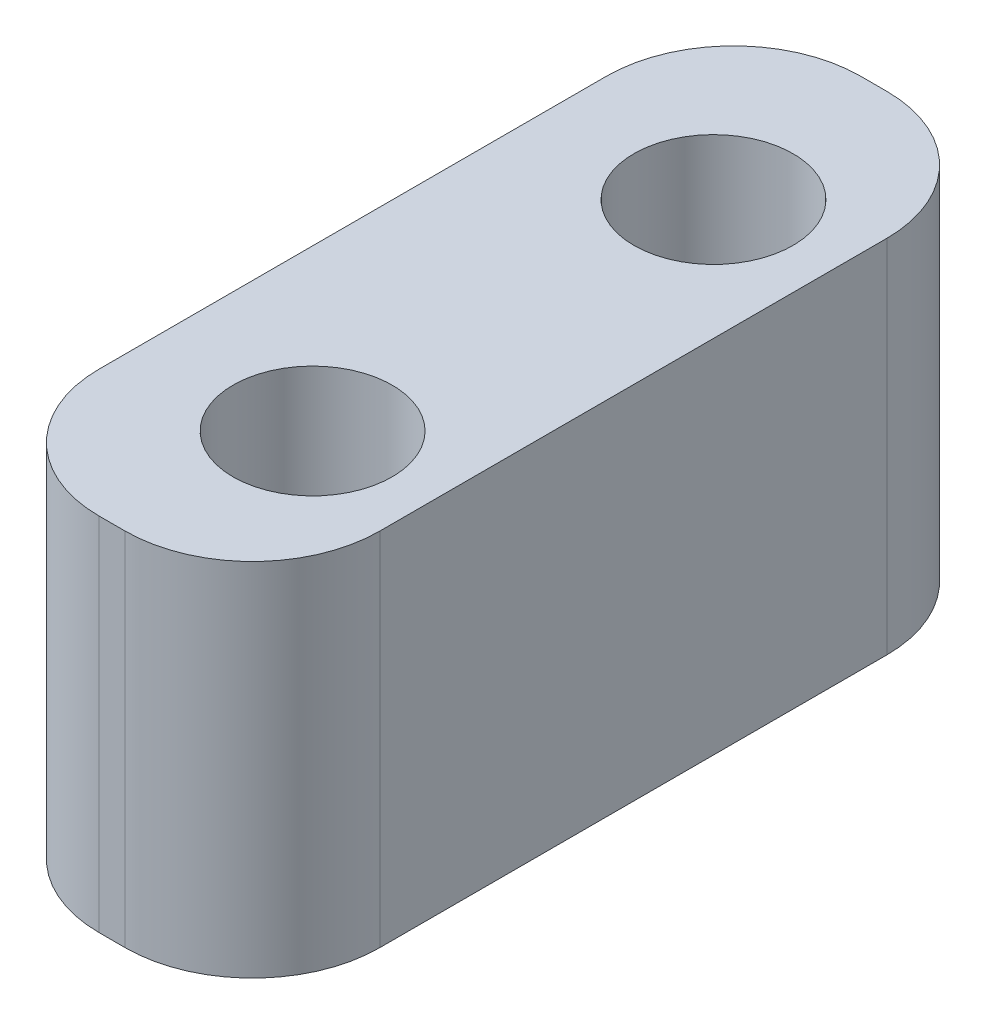
ISO-10303-21;
HEADER;
FILE_DESCRIPTION(('STEP AP214'),'2;1');
FILE_NAME('part.step','',(''),(''),'','','');
FILE_SCHEMA(('AUTOMOTIVE_DESIGN { 1 0 10303 214 1 1 1 1 }'));
ENDSEC;
DATA;
#1=APPLICATION_CONTEXT('core data for automotive mechanical design processes');
#2=APPLICATION_PROTOCOL_DEFINITION('international standard','automotive_design',2000,#1);
#3=PRODUCT_CONTEXT('',#1,'mechanical');
#4=PRODUCT('Part','Part','',(#3));
#5=PRODUCT_RELATED_PRODUCT_CATEGORY('part','',(#4));
#6=PRODUCT_DEFINITION_FORMATION('','',#4);
#7=PRODUCT_DEFINITION_CONTEXT('part definition',#1,'design');
#8=PRODUCT_DEFINITION('design','',#6,#7);
#9=PRODUCT_DEFINITION_SHAPE('','',#8);
#10=(LENGTH_UNIT() NAMED_UNIT(*) SI_UNIT(.MILLI.,.METRE.));
#11=(NAMED_UNIT(*) PLANE_ANGLE_UNIT() SI_UNIT($,.RADIAN.));
#12=(NAMED_UNIT(*) SI_UNIT($,.STERADIAN.) SOLID_ANGLE_UNIT());
#13=UNCERTAINTY_MEASURE_WITH_UNIT(LENGTH_MEASURE(1.E-05),#10,'distance_accuracy_value','');
#14=(GEOMETRIC_REPRESENTATION_CONTEXT(3) GLOBAL_UNCERTAINTY_ASSIGNED_CONTEXT((#13)) GLOBAL_UNIT_ASSIGNED_CONTEXT((#10,
#11,#12)) REPRESENTATION_CONTEXT('',''));
#15=CARTESIAN_POINT('',(0.,0.,0.));
#16=DIRECTION('',(0.,0.,1.));
#17=DIRECTION('',(1.,0.,0.));
#18=AXIS2_PLACEMENT_3D('',#15,#16,#17);
#19=CARTESIAN_POINT('',(0.,0.,19.));
#20=DIRECTION('',(1.,0.,0.));
#21=DIRECTION('',(0.,0.,-1.));
#22=AXIS2_PLACEMENT_3D('',#19,#20,#21);
#23=PLANE('',#22);
#24=DIRECTION('',(0.,0.,-1.));
#25=VECTOR('',#24,1.);
#26=CARTESIAN_POINT('',(0.,9.,19.));
#27=LINE('',#26,#25);
#28=CARTESIAN_POINT('',(0.,9.,15.825));
#29=VERTEX_POINT('',#28);
#30=CARTESIAN_POINT('',(0.,9.,3.175));
#31=VERTEX_POINT('',#30);
#32=EDGE_CURVE('E150',#29,#31,#27,.T.);
#33=ORIENTED_EDGE('',*,*,#32,.T.);
#34=DIRECTION('',(0.,-1.,0.));
#35=VECTOR('',#34,1.);
#36=CARTESIAN_POINT('',(0.,0.,3.175));
#37=LINE('',#36,#35);
#38=CARTESIAN_POINT('',(0.,0.,3.175));
#39=VERTEX_POINT('',#38);
#40=EDGE_CURVE('E112',#31,#39,#37,.T.);
#41=ORIENTED_EDGE('',*,*,#40,.T.);
#42=DIRECTION('',(0.,0.,-1.));
#43=VECTOR('',#42,1.);
#44=CARTESIAN_POINT('',(0.,0.,19.));
#45=LINE('',#44,#43);
#46=CARTESIAN_POINT('',(0.,0.,15.825));
#47=VERTEX_POINT('',#46);
#48=EDGE_CURVE('E104',#47,#39,#45,.T.);
#49=ORIENTED_EDGE('',*,*,#48,.F.);
#50=DIRECTION('',(0.,-1.,0.));
#51=VECTOR('',#50,1.);
#52=CARTESIAN_POINT('',(0.,0.,15.825));
#53=LINE('',#52,#51);
#54=EDGE_CURVE('E117',#47,#29,#53,.F.);
#55=ORIENTED_EDGE('',*,*,#54,.T.);
#56=EDGE_LOOP('',(#33,#41,#49,#55));
#57=FACE_BOUND('',#56,.T.);
#58=ADVANCED_FACE('F34',(#57),#23,.F.);
#59=CARTESIAN_POINT('',(0.,0.,19.));
#60=DIRECTION('',(0.,1.,0.));
#61=DIRECTION('',(0.,0.,1.));
#62=AXIS2_PLACEMENT_3D('',#59,#60,#61);
#63=PLANE('',#62);
#64=CARTESIAN_POINT('',(4.,0.,4.5));
#65=DIRECTION('',(0.,1.,0.));
#66=DIRECTION('',(0.,0.,1.));
#67=AXIS2_PLACEMENT_3D('',#64,#65,#66);
#68=CIRCLE('',#67,1.984375);
#69=CARTESIAN_POINT('',(4.,0.,6.484375));
#70=VERTEX_POINT('',#69);
#71=EDGE_CURVE('E161',#70,#70,#68,.F.);
#72=ORIENTED_EDGE('',*,*,#71,.F.);
#73=EDGE_LOOP('',(#72));
#74=FACE_BOUND('',#73,.T.);
#75=CARTESIAN_POINT('',(4.,0.,14.5));
#76=DIRECTION('',(0.,1.,0.));
#77=DIRECTION('',(0.,0.,1.));
#78=AXIS2_PLACEMENT_3D('',#75,#76,#77);
#79=CIRCLE('',#78,1.984375);
#80=CARTESIAN_POINT('',(4.,0.,16.484375));
#81=VERTEX_POINT('',#80);
#82=EDGE_CURVE('E293',#81,#81,#79,.F.);
#83=ORIENTED_EDGE('',*,*,#82,.F.);
#84=EDGE_LOOP('',(#83));
#85=FACE_BOUND('',#84,.T.);
#86=ORIENTED_EDGE('',*,*,#48,.T.);
#87=CARTESIAN_POINT('',(3.175,0.,3.175));
#88=DIRECTION('',(0.,1.,0.));
#89=DIRECTION('',(0.,0.,1.));
#90=AXIS2_PLACEMENT_3D('',#87,#88,#89);
#91=CIRCLE('',#90,3.175);
#92=CARTESIAN_POINT('',(3.175,0.,0.));
#93=VERTEX_POINT('',#92);
#94=EDGE_CURVE('E131',#39,#93,#91,.F.);
#95=ORIENTED_EDGE('',*,*,#94,.T.);
#96=DIRECTION('',(1.,0.,0.));
#97=VECTOR('',#96,1.);
#98=CARTESIAN_POINT('',(0.,0.,0.));
#99=LINE('',#98,#97);
#100=CARTESIAN_POINT('',(3.825,0.,0.));
#101=VERTEX_POINT('',#100);
#102=EDGE_CURVE('E158',#93,#101,#99,.T.);
#103=ORIENTED_EDGE('',*,*,#102,.T.);
#104=CARTESIAN_POINT('',(3.825,0.,3.175));
#105=DIRECTION('',(0.,1.,0.));
#106=DIRECTION('',(0.,0.,1.));
#107=AXIS2_PLACEMENT_3D('',#104,#105,#106);
#108=CIRCLE('',#107,3.175);
#109=CARTESIAN_POINT('',(7.,0.,3.175));
#110=VERTEX_POINT('',#109);
#111=EDGE_CURVE('E129',#101,#110,#108,.F.);
#112=ORIENTED_EDGE('',*,*,#111,.T.);
#113=DIRECTION('',(0.,0.,-1.));
#114=VECTOR('',#113,1.);
#115=CARTESIAN_POINT('',(7.,0.,19.));
#116=LINE('',#115,#114);
#117=CARTESIAN_POINT('',(7.,0.,15.825));
#118=VERTEX_POINT('',#117);
#119=EDGE_CURVE('E120',#118,#110,#116,.T.);
#120=ORIENTED_EDGE('',*,*,#119,.F.);
#121=CARTESIAN_POINT('',(3.825,0.,15.825));
#122=DIRECTION('',(0.,1.,0.));
#123=DIRECTION('',(0.,0.,1.));
#124=AXIS2_PLACEMENT_3D('',#121,#122,#123);
#125=CIRCLE('',#124,3.175);
#126=CARTESIAN_POINT('',(3.825,0.,19.));
#127=VERTEX_POINT('',#126);
#128=EDGE_CURVE('E111',#118,#127,#125,.F.);
#129=ORIENTED_EDGE('',*,*,#128,.T.);
#130=DIRECTION('',(1.,0.,0.));
#131=VECTOR('',#130,1.);
#132=CARTESIAN_POINT('',(0.,0.,19.));
#133=LINE('',#132,#131);
#134=CARTESIAN_POINT('',(3.175,0.,19.));
#135=VERTEX_POINT('',#134);
#136=EDGE_CURVE('E106',#135,#127,#133,.T.);
#137=ORIENTED_EDGE('',*,*,#136,.F.);
#138=CARTESIAN_POINT('',(3.175,0.,15.825));
#139=DIRECTION('',(0.,1.,0.));
#140=DIRECTION('',(0.,0.,1.));
#141=AXIS2_PLACEMENT_3D('',#138,#139,#140);
#142=CIRCLE('',#141,3.175);
#143=EDGE_CURVE('E101',#135,#47,#142,.F.);
#144=ORIENTED_EDGE('',*,*,#143,.T.);
#145=EDGE_LOOP('',(#86,#95,#103,#112,#120,#129,#137,#144));
#146=FACE_BOUND('',#145,.T.);
#147=ADVANCED_FACE('F103',(#74,#85,#146),#63,.F.);
#148=CARTESIAN_POINT('',(7.,0.,19.));
#149=DIRECTION('',(-1.,0.,0.));
#150=DIRECTION('',(0.,0.,1.));
#151=AXIS2_PLACEMENT_3D('',#148,#149,#150);
#152=PLANE('',#151);
#153=ORIENTED_EDGE('',*,*,#119,.T.);
#154=DIRECTION('',(0.,1.,0.));
#155=VECTOR('',#154,1.);
#156=CARTESIAN_POINT('',(7.,9.,3.175));
#157=LINE('',#156,#155);
#158=CARTESIAN_POINT('',(7.,9.,3.175));
#159=VERTEX_POINT('',#158);
#160=EDGE_CURVE('E144',#110,#159,#157,.T.);
#161=ORIENTED_EDGE('',*,*,#160,.T.);
#162=DIRECTION('',(0.,0.,-1.));
#163=VECTOR('',#162,1.);
#164=CARTESIAN_POINT('',(7.,9.,19.));
#165=LINE('',#164,#163);
#166=CARTESIAN_POINT('',(7.,9.,15.825));
#167=VERTEX_POINT('',#166);
#168=EDGE_CURVE('E152',#167,#159,#165,.T.);
#169=ORIENTED_EDGE('',*,*,#168,.F.);
#170=DIRECTION('',(0.,1.,0.));
#171=VECTOR('',#170,1.);
#172=CARTESIAN_POINT('',(7.,0.,15.825));
#173=LINE('',#172,#171);
#174=EDGE_CURVE('E142',#167,#118,#173,.F.);
#175=ORIENTED_EDGE('',*,*,#174,.T.);
#176=EDGE_LOOP('',(#153,#161,#169,#175));
#177=FACE_BOUND('',#176,.T.);
#178=ADVANCED_FACE('F167',(#177),#152,.F.);
#179=CARTESIAN_POINT('',(0.,9.,19.));
#180=DIRECTION('',(0.,-1.,0.));
#181=DIRECTION('',(0.,0.,-1.));
#182=AXIS2_PLACEMENT_3D('',#179,#180,#181);
#183=PLANE('',#182);
#184=CARTESIAN_POINT('',(4.,9.,4.5));
#185=DIRECTION('',(0.,1.,0.));
#186=DIRECTION('',(0.,0.,1.));
#187=AXIS2_PLACEMENT_3D('',#184,#185,#186);
#188=CIRCLE('',#187,1.984375);
#189=CARTESIAN_POINT('',(4.,9.,6.484375));
#190=VERTEX_POINT('',#189);
#191=EDGE_CURVE('E288',#190,#190,#188,.T.);
#192=ORIENTED_EDGE('',*,*,#191,.F.);
#193=EDGE_LOOP('',(#192));
#194=FACE_BOUND('',#193,.T.);
#195=CARTESIAN_POINT('',(4.,9.,14.5));
#196=DIRECTION('',(0.,1.,0.));
#197=DIRECTION('',(0.,0.,1.));
#198=AXIS2_PLACEMENT_3D('',#195,#196,#197);
#199=CIRCLE('',#198,1.984375);
#200=CARTESIAN_POINT('',(4.,9.,16.484375));
#201=VERTEX_POINT('',#200);
#202=EDGE_CURVE('E291',#201,#201,#199,.T.);
#203=ORIENTED_EDGE('',*,*,#202,.F.);
#204=EDGE_LOOP('',(#203));
#205=FACE_BOUND('',#204,.T.);
#206=DIRECTION('',(-1.,0.,0.));
#207=VECTOR('',#206,1.);
#208=CARTESIAN_POINT('',(0.,9.,0.));
#209=LINE('',#208,#207);
#210=CARTESIAN_POINT('',(3.825,9.,0.));
#211=VERTEX_POINT('',#210);
#212=CARTESIAN_POINT('',(3.175,9.,0.));
#213=VERTEX_POINT('',#212);
#214=EDGE_CURVE('E154',#211,#213,#209,.T.);
#215=ORIENTED_EDGE('',*,*,#214,.T.);
#216=CARTESIAN_POINT('',(3.175,9.,3.175));
#217=DIRECTION('',(0.,-1.,0.));
#218=DIRECTION('',(0.,0.,-1.));
#219=AXIS2_PLACEMENT_3D('',#216,#217,#218);
#220=CIRCLE('',#219,3.175);
#221=EDGE_CURVE('E140',#213,#31,#220,.F.);
#222=ORIENTED_EDGE('',*,*,#221,.T.);
#223=ORIENTED_EDGE('',*,*,#32,.F.);
#224=CARTESIAN_POINT('',(3.175,9.,15.825));
#225=DIRECTION('',(0.,-1.,0.));
#226=DIRECTION('',(0.,0.,-1.));
#227=AXIS2_PLACEMENT_3D('',#224,#225,#226);
#228=CIRCLE('',#227,3.175);
#229=CARTESIAN_POINT('',(3.175,9.,19.));
#230=VERTEX_POINT('',#229);
#231=EDGE_CURVE('E123',#29,#230,#228,.F.);
#232=ORIENTED_EDGE('',*,*,#231,.T.);
#233=DIRECTION('',(-1.,0.,0.));
#234=VECTOR('',#233,1.);
#235=CARTESIAN_POINT('',(0.,9.,19.));
#236=LINE('',#235,#234);
#237=CARTESIAN_POINT('',(3.825,9.,19.));
#238=VERTEX_POINT('',#237);
#239=EDGE_CURVE('E149',#238,#230,#236,.T.);
#240=ORIENTED_EDGE('',*,*,#239,.F.);
#241=CARTESIAN_POINT('',(3.825,9.,15.825));
#242=DIRECTION('',(0.,-1.,0.));
#243=DIRECTION('',(0.,0.,-1.));
#244=AXIS2_PLACEMENT_3D('',#241,#242,#243);
#245=CIRCLE('',#244,3.175);
#246=EDGE_CURVE('E57',#238,#167,#245,.F.);
#247=ORIENTED_EDGE('',*,*,#246,.T.);
#248=ORIENTED_EDGE('',*,*,#168,.T.);
#249=CARTESIAN_POINT('',(3.825,9.,3.175));
#250=DIRECTION('',(0.,-1.,0.));
#251=DIRECTION('',(0.,0.,-1.));
#252=AXIS2_PLACEMENT_3D('',#249,#250,#251);
#253=CIRCLE('',#252,3.175);
#254=EDGE_CURVE('E49',#159,#211,#253,.F.);
#255=ORIENTED_EDGE('',*,*,#254,.T.);
#256=EDGE_LOOP('',(#215,#222,#223,#232,#240,#247,#248,#255));
#257=FACE_BOUND('',#256,.T.);
#258=ADVANCED_FACE('F180',(#194,#205,#257),#183,.F.);
#259=CARTESIAN_POINT('',(0.,0.,19.));
#260=DIRECTION('',(0.,0.,-1.));
#261=DIRECTION('',(-1.,0.,0.));
#262=AXIS2_PLACEMENT_3D('',#259,#260,#261);
#263=PLANE('',#262);
#264=ORIENTED_EDGE('',*,*,#136,.T.);
#265=DIRECTION('',(0.,1.,0.));
#266=VECTOR('',#265,1.);
#267=CARTESIAN_POINT('',(3.825,0.,19.));
#268=LINE('',#267,#266);
#269=EDGE_CURVE('E11',#127,#238,#268,.T.);
#270=ORIENTED_EDGE('',*,*,#269,.T.);
#271=ORIENTED_EDGE('',*,*,#239,.T.);
#272=DIRECTION('',(0.,-1.,0.));
#273=VECTOR('',#272,1.);
#274=CARTESIAN_POINT('',(3.175,0.,19.));
#275=LINE('',#274,#273);
#276=EDGE_CURVE('E42',#230,#135,#275,.T.);
#277=ORIENTED_EDGE('',*,*,#276,.T.);
#278=EDGE_LOOP('',(#264,#270,#271,#277));
#279=FACE_BOUND('',#278,.T.);
#280=ADVANCED_FACE('F147',(#279),#263,.F.);
#281=CARTESIAN_POINT('',(0.,0.,0.));
#282=DIRECTION('',(0.,0.,-1.));
#283=DIRECTION('',(-1.,0.,0.));
#284=AXIS2_PLACEMENT_3D('',#281,#282,#283);
#285=PLANE('',#284);
#286=ORIENTED_EDGE('',*,*,#102,.F.);
#287=DIRECTION('',(0.,-1.,0.));
#288=VECTOR('',#287,1.);
#289=CARTESIAN_POINT('',(3.175,9.,0.));
#290=LINE('',#289,#288);
#291=EDGE_CURVE('E135',#93,#213,#290,.F.);
#292=ORIENTED_EDGE('',*,*,#291,.T.);
#293=ORIENTED_EDGE('',*,*,#214,.F.);
#294=DIRECTION('',(0.,1.,0.));
#295=VECTOR('',#294,1.);
#296=CARTESIAN_POINT('',(3.825,0.,0.));
#297=LINE('',#296,#295);
#298=EDGE_CURVE('E133',#211,#101,#297,.F.);
#299=ORIENTED_EDGE('',*,*,#298,.T.);
#300=EDGE_LOOP('',(#286,#292,#293,#299));
#301=FACE_BOUND('',#300,.T.);
#302=ADVANCED_FACE('F175',(#301),#285,.T.);
#303=CARTESIAN_POINT('',(4.,-5.61266007566822,14.5));
#304=DIRECTION('',(0.,1.,0.));
#305=DIRECTION('',(0.,0.,1.));
#306=AXIS2_PLACEMENT_3D('',#303,#304,#305);
#307=CYLINDRICAL_SURFACE('',#306,1.984375);
#308=ORIENTED_EDGE('',*,*,#82,.T.);
#309=EDGE_LOOP('',(#308));
#310=FACE_BOUND('',#309,.T.);
#311=ORIENTED_EDGE('',*,*,#202,.T.);
#312=EDGE_LOOP('',(#311));
#313=FACE_BOUND('',#312,.T.);
#314=ADVANCED_FACE('F203',(#310,#313),#307,.F.);
#315=CARTESIAN_POINT('',(4.,-5.61266007566822,4.5));
#316=DIRECTION('',(0.,1.,0.));
#317=DIRECTION('',(0.,0.,1.));
#318=AXIS2_PLACEMENT_3D('',#315,#316,#317);
#319=CYLINDRICAL_SURFACE('',#318,1.984375);
#320=ORIENTED_EDGE('',*,*,#71,.T.);
#321=EDGE_LOOP('',(#320));
#322=FACE_BOUND('',#321,.T.);
#323=ORIENTED_EDGE('',*,*,#191,.T.);
#324=EDGE_LOOP('',(#323));
#325=FACE_BOUND('',#324,.T.);
#326=ADVANCED_FACE('F199',(#322,#325),#319,.F.);
#327=CARTESIAN_POINT('',(3.175,0.,3.175));
#328=DIRECTION('',(0.,1.,0.));
#329=DIRECTION('',(0.,0.,1.));
#330=AXIS2_PLACEMENT_3D('',#327,#328,#329);
#331=CYLINDRICAL_SURFACE('',#330,3.175);
#332=ORIENTED_EDGE('',*,*,#221,.F.);
#333=ORIENTED_EDGE('',*,*,#291,.F.);
#334=ORIENTED_EDGE('',*,*,#94,.F.);
#335=ORIENTED_EDGE('',*,*,#40,.F.);
#336=EDGE_LOOP('',(#332,#333,#334,#335));
#337=FACE_BOUND('',#336,.T.);
#338=ADVANCED_FACE('F179',(#337),#331,.T.);
#339=CARTESIAN_POINT('',(3.825,0.,3.175));
#340=DIRECTION('',(0.,-1.,0.));
#341=DIRECTION('',(0.,0.,-1.));
#342=AXIS2_PLACEMENT_3D('',#339,#340,#341);
#343=CYLINDRICAL_SURFACE('',#342,3.175);
#344=ORIENTED_EDGE('',*,*,#111,.F.);
#345=ORIENTED_EDGE('',*,*,#298,.F.);
#346=ORIENTED_EDGE('',*,*,#254,.F.);
#347=ORIENTED_EDGE('',*,*,#160,.F.);
#348=EDGE_LOOP('',(#344,#345,#346,#347));
#349=FACE_BOUND('',#348,.T.);
#350=ADVANCED_FACE('F171',(#349),#343,.T.);
#351=CARTESIAN_POINT('',(3.825,0.,15.825));
#352=DIRECTION('',(0.,1.,0.));
#353=DIRECTION('',(0.,0.,1.));
#354=AXIS2_PLACEMENT_3D('',#351,#352,#353);
#355=CYLINDRICAL_SURFACE('',#354,3.175);
#356=ORIENTED_EDGE('',*,*,#128,.F.);
#357=ORIENTED_EDGE('',*,*,#174,.F.);
#358=ORIENTED_EDGE('',*,*,#246,.F.);
#359=ORIENTED_EDGE('',*,*,#269,.F.);
#360=EDGE_LOOP('',(#356,#357,#358,#359));
#361=FACE_BOUND('',#360,.T.);
#362=ADVANCED_FACE('F182',(#361),#355,.T.);
#363=CARTESIAN_POINT('',(3.175,0.,15.825));
#364=DIRECTION('',(0.,-1.,0.));
#365=DIRECTION('',(0.,0.,-1.));
#366=AXIS2_PLACEMENT_3D('',#363,#364,#365);
#367=CYLINDRICAL_SURFACE('',#366,3.175);
#368=ORIENTED_EDGE('',*,*,#231,.F.);
#369=ORIENTED_EDGE('',*,*,#54,.F.);
#370=ORIENTED_EDGE('',*,*,#143,.F.);
#371=ORIENTED_EDGE('',*,*,#276,.F.);
#372=EDGE_LOOP('',(#368,#369,#370,#371));
#373=FACE_BOUND('',#372,.T.);
#374=ADVANCED_FACE('F36',(#373),#367,.T.);
#375=CLOSED_SHELL('',(#58,#147,#178,#258,#280,#302,#314,#326,#338,#350,#362,#374));
#376=MANIFOLD_SOLID_BREP('B2',#375);
#377=ADVANCED_BREP_SHAPE_REPRESENTATION('',(#18,#376),#14);
#378=SHAPE_DEFINITION_REPRESENTATION(#9,#377);
ENDSEC;
END-ISO-10303-21;
